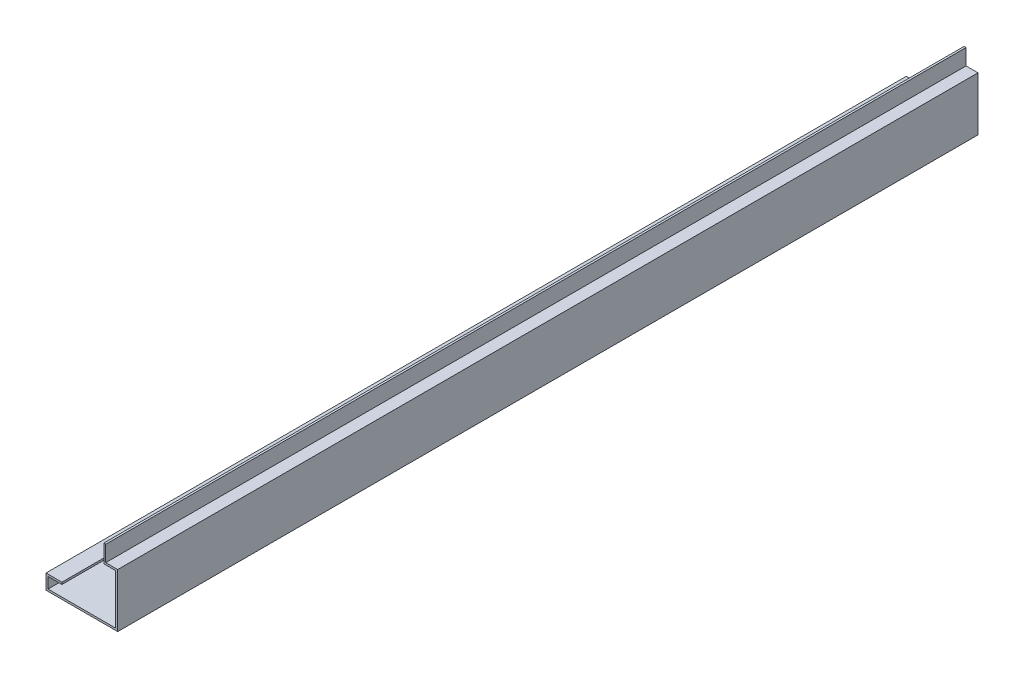
ISO-10303-21;
HEADER;
FILE_DESCRIPTION(('STEP AP214'),'2;1');
FILE_NAME('part.step','',(''),(''),'','','');
FILE_SCHEMA(('AUTOMOTIVE_DESIGN { 1 0 10303 214 1 1 1 1 }'));
ENDSEC;
DATA;
#1=APPLICATION_CONTEXT('core data for automotive mechanical design processes');
#2=APPLICATION_PROTOCOL_DEFINITION('international standard','automotive_design',2000,#1);
#3=PRODUCT_CONTEXT('',#1,'mechanical');
#4=PRODUCT('Part','Part','',(#3));
#5=PRODUCT_RELATED_PRODUCT_CATEGORY('part','',(#4));
#6=PRODUCT_DEFINITION_FORMATION('','',#4);
#7=PRODUCT_DEFINITION_CONTEXT('part definition',#1,'design');
#8=PRODUCT_DEFINITION('design','',#6,#7);
#9=PRODUCT_DEFINITION_SHAPE('','',#8);
#10=(LENGTH_UNIT() NAMED_UNIT(*) SI_UNIT(.MILLI.,.METRE.));
#11=(NAMED_UNIT(*) PLANE_ANGLE_UNIT() SI_UNIT($,.RADIAN.));
#12=(NAMED_UNIT(*) SI_UNIT($,.STERADIAN.) SOLID_ANGLE_UNIT());
#13=UNCERTAINTY_MEASURE_WITH_UNIT(LENGTH_MEASURE(1.E-05),#10,'distance_accuracy_value','');
#14=(GEOMETRIC_REPRESENTATION_CONTEXT(3) GLOBAL_UNCERTAINTY_ASSIGNED_CONTEXT((#13)) GLOBAL_UNIT_ASSIGNED_CONTEXT((#10,
#11,#12)) REPRESENTATION_CONTEXT('',''));
#15=CARTESIAN_POINT('',(0.,0.,0.));
#16=DIRECTION('',(0.,0.,1.));
#17=DIRECTION('',(1.,0.,0.));
#18=AXIS2_PLACEMENT_3D('',#15,#16,#17);
#19=CARTESIAN_POINT('',(-184.15,-180.975,-2743.2));
#20=DIRECTION('',(1.,0.,0.));
#21=DIRECTION('',(0.,0.,-1.));
#22=AXIS2_PLACEMENT_3D('',#19,#20,#21);
#23=PLANE('',#22);
#24=DIRECTION('',(0.,1.,0.));
#25=VECTOR('',#24,1.);
#26=CARTESIAN_POINT('',(-184.15,-180.975,0.));
#27=LINE('',#26,#25);
#28=CARTESIAN_POINT('',(-184.15,-215.9,0.));
#29=VERTEX_POINT('',#28);
#30=CARTESIAN_POINT('',(-184.15,-180.975,0.));
#31=VERTEX_POINT('',#30);
#32=EDGE_CURVE('E183',#29,#31,#27,.T.);
#33=ORIENTED_EDGE('',*,*,#32,.F.);
#34=DIRECTION('',(0.,0.,1.));
#35=VECTOR('',#34,1.);
#36=CARTESIAN_POINT('',(-184.15,-215.9,-2743.2));
#37=LINE('',#36,#35);
#38=CARTESIAN_POINT('',(-184.15,-215.9,-2743.2));
#39=VERTEX_POINT('',#38);
#40=EDGE_CURVE('E11',#39,#29,#37,.T.);
#41=ORIENTED_EDGE('',*,*,#40,.F.);
#42=DIRECTION('',(0.,1.,0.));
#43=VECTOR('',#42,1.);
#44=CARTESIAN_POINT('',(-184.15,-180.975,-2743.2));
#45=LINE('',#44,#43);
#46=CARTESIAN_POINT('',(-184.15,-180.975,-2743.2));
#47=VERTEX_POINT('',#46);
#48=EDGE_CURVE('E235',#39,#47,#45,.T.);
#49=ORIENTED_EDGE('',*,*,#48,.T.);
#50=DIRECTION('',(0.,0.,1.));
#51=VECTOR('',#50,1.);
#52=CARTESIAN_POINT('',(-184.15,-180.975,-2743.2));
#53=LINE('',#52,#51);
#54=EDGE_CURVE('E46',#47,#31,#53,.T.);
#55=ORIENTED_EDGE('',*,*,#54,.T.);
#56=EDGE_LOOP('',(#33,#41,#49,#55));
#57=FACE_BOUND('',#56,.T.);
#58=ADVANCED_FACE('F43',(#57),#23,.T.);
#59=CARTESIAN_POINT('',(-184.15,-215.9,-2743.2));
#60=DIRECTION('',(0.,1.,0.));
#61=DIRECTION('',(0.,0.,1.));
#62=AXIS2_PLACEMENT_3D('',#59,#60,#61);
#63=PLANE('',#62);
#64=DIRECTION('',(-1.,0.,0.));
#65=VECTOR('',#64,1.);
#66=CARTESIAN_POINT('',(-184.15,-215.9,0.));
#67=LINE('',#66,#65);
#68=CARTESIAN_POINT('',(31.75,-215.9,0.));
#69=VERTEX_POINT('',#68);
#70=EDGE_CURVE('E232',#69,#29,#67,.T.);
#71=ORIENTED_EDGE('',*,*,#70,.F.);
#72=DIRECTION('',(0.,0.,1.));
#73=VECTOR('',#72,1.);
#74=CARTESIAN_POINT('',(31.75,-215.9,-2743.2));
#75=LINE('',#74,#73);
#76=CARTESIAN_POINT('',(31.75,-215.9,-2743.2));
#77=VERTEX_POINT('',#76);
#78=EDGE_CURVE('E53',#77,#69,#75,.T.);
#79=ORIENTED_EDGE('',*,*,#78,.F.);
#80=DIRECTION('',(-1.,0.,0.));
#81=VECTOR('',#80,1.);
#82=CARTESIAN_POINT('',(-184.15,-215.9,-2743.2));
#83=LINE('',#82,#81);
#84=EDGE_CURVE('E168',#77,#39,#83,.T.);
#85=ORIENTED_EDGE('',*,*,#84,.T.);
#86=ORIENTED_EDGE('',*,*,#40,.T.);
#87=EDGE_LOOP('',(#71,#79,#85,#86));
#88=FACE_BOUND('',#87,.T.);
#89=ADVANCED_FACE('F273',(#88),#63,.T.);
#90=CARTESIAN_POINT('',(31.75,-215.9,-2743.2));
#91=DIRECTION('',(-1.,0.,0.));
#92=DIRECTION('',(0.,0.,1.));
#93=AXIS2_PLACEMENT_3D('',#90,#91,#92);
#94=PLANE('',#93);
#95=DIRECTION('',(0.,-1.,0.));
#96=VECTOR('',#95,1.);
#97=CARTESIAN_POINT('',(31.75,-215.9,0.));
#98=LINE('',#97,#96);
#99=CARTESIAN_POINT('',(31.75,-57.15,0.));
#100=VERTEX_POINT('',#99);
#101=EDGE_CURVE('E154',#100,#69,#98,.T.);
#102=ORIENTED_EDGE('',*,*,#101,.F.);
#103=DIRECTION('',(0.,0.,1.));
#104=VECTOR('',#103,1.);
#105=CARTESIAN_POINT('',(31.75,-57.15,-2743.2));
#106=LINE('',#105,#104);
#107=CARTESIAN_POINT('',(31.75,-57.15,-2743.2));
#108=VERTEX_POINT('',#107);
#109=EDGE_CURVE('E149',#108,#100,#106,.T.);
#110=ORIENTED_EDGE('',*,*,#109,.F.);
#111=DIRECTION('',(0.,-1.,0.));
#112=VECTOR('',#111,1.);
#113=CARTESIAN_POINT('',(31.75,-215.9,-2743.2));
#114=LINE('',#113,#112);
#115=EDGE_CURVE('E152',#108,#77,#114,.T.);
#116=ORIENTED_EDGE('',*,*,#115,.T.);
#117=ORIENTED_EDGE('',*,*,#78,.T.);
#118=EDGE_LOOP('',(#102,#110,#116,#117));
#119=FACE_BOUND('',#118,.T.);
#120=ADVANCED_FACE('F151',(#119),#94,.T.);
#121=CARTESIAN_POINT('',(31.75,-57.15,-2743.2));
#122=DIRECTION('',(0.,-1.,0.));
#123=DIRECTION('',(1.,0.,0.));
#124=AXIS2_PLACEMENT_3D('',#121,#122,#123);
#125=PLANE('',#124);
#126=DIRECTION('',(1.,0.,0.));
#127=VECTOR('',#126,1.);
#128=CARTESIAN_POINT('',(31.75,-57.15,0.));
#129=LINE('',#128,#127);
#130=CARTESIAN_POINT('',(-6.34999999999999,-57.15,0.));
#131=VERTEX_POINT('',#130);
#132=EDGE_CURVE('E227',#131,#100,#129,.T.);
#133=ORIENTED_EDGE('',*,*,#132,.F.);
#134=DIRECTION('',(0.,0.,1.));
#135=VECTOR('',#134,1.);
#136=CARTESIAN_POINT('',(-6.34999999999999,-57.15,-2743.2));
#137=LINE('',#136,#135);
#138=CARTESIAN_POINT('',(-6.34999999999999,-57.15,-2743.2));
#139=VERTEX_POINT('',#138);
#140=EDGE_CURVE('E160',#139,#131,#137,.T.);
#141=ORIENTED_EDGE('',*,*,#140,.F.);
#142=DIRECTION('',(1.,0.,0.));
#143=VECTOR('',#142,1.);
#144=CARTESIAN_POINT('',(31.75,-57.15,-2743.2));
#145=LINE('',#144,#143);
#146=EDGE_CURVE('E166',#139,#108,#145,.T.);
#147=ORIENTED_EDGE('',*,*,#146,.T.);
#148=ORIENTED_EDGE('',*,*,#109,.T.);
#149=EDGE_LOOP('',(#133,#141,#147,#148));
#150=FACE_BOUND('',#149,.T.);
#151=ADVANCED_FACE('F171',(#150),#125,.T.);
#152=CARTESIAN_POINT('',(-6.34999999999999,-57.15,-2743.2));
#153=DIRECTION('',(-1.,0.,0.));
#154=DIRECTION('',(0.,0.,1.));
#155=AXIS2_PLACEMENT_3D('',#152,#153,#154);
#156=PLANE('',#155);
#157=DIRECTION('',(0.,-1.,0.));
#158=VECTOR('',#157,1.);
#159=CARTESIAN_POINT('',(-6.34999999999999,-57.15,0.));
#160=LINE('',#159,#158);
#161=CARTESIAN_POINT('',(-6.34999999999999,0.,0.));
#162=VERTEX_POINT('',#161);
#163=EDGE_CURVE('E223',#162,#131,#160,.T.);
#164=ORIENTED_EDGE('',*,*,#163,.F.);
#165=DIRECTION('',(0.,0.,1.));
#166=VECTOR('',#165,1.);
#167=CARTESIAN_POINT('',(-6.34999999999999,0.,-2743.2));
#168=LINE('',#167,#166);
#169=CARTESIAN_POINT('',(-6.34999999999999,0.,-2743.2));
#170=VERTEX_POINT('',#169);
#171=EDGE_CURVE('E241',#170,#162,#168,.T.);
#172=ORIENTED_EDGE('',*,*,#171,.F.);
#173=DIRECTION('',(0.,-1.,0.));
#174=VECTOR('',#173,1.);
#175=CARTESIAN_POINT('',(-6.34999999999999,-57.15,-2743.2));
#176=LINE('',#175,#174);
#177=EDGE_CURVE('E173',#170,#139,#176,.T.);
#178=ORIENTED_EDGE('',*,*,#177,.T.);
#179=ORIENTED_EDGE('',*,*,#140,.T.);
#180=EDGE_LOOP('',(#164,#172,#178,#179));
#181=FACE_BOUND('',#180,.T.);
#182=ADVANCED_FACE('F286',(#181),#156,.T.);
#183=CARTESIAN_POINT('',(-6.34999999999999,0.,-2743.2));
#184=DIRECTION('',(0.,1.,0.));
#185=DIRECTION('',(0.,0.,1.));
#186=AXIS2_PLACEMENT_3D('',#183,#184,#185);
#187=PLANE('',#186);
#188=DIRECTION('',(-1.,0.,0.));
#189=VECTOR('',#188,1.);
#190=CARTESIAN_POINT('',(-6.34999999999999,0.,0.));
#191=LINE('',#190,#189);
#192=CARTESIAN_POINT('',(0.,0.,0.));
#193=VERTEX_POINT('',#192);
#194=EDGE_CURVE('E219',#193,#162,#191,.T.);
#195=ORIENTED_EDGE('',*,*,#194,.F.);
#196=DIRECTION('',(0.,0.,1.));
#197=VECTOR('',#196,1.);
#198=CARTESIAN_POINT('',(0.,0.,-2743.2));
#199=LINE('',#198,#197);
#200=CARTESIAN_POINT('',(0.,0.,-2743.2));
#201=VERTEX_POINT('',#200);
#202=EDGE_CURVE('E244',#201,#193,#199,.T.);
#203=ORIENTED_EDGE('',*,*,#202,.F.);
#204=DIRECTION('',(-1.,0.,0.));
#205=VECTOR('',#204,1.);
#206=CARTESIAN_POINT('',(-6.34999999999999,0.,-2743.2));
#207=LINE('',#206,#205);
#208=EDGE_CURVE('E177',#201,#170,#207,.T.);
#209=ORIENTED_EDGE('',*,*,#208,.T.);
#210=ORIENTED_EDGE('',*,*,#171,.T.);
#211=EDGE_LOOP('',(#195,#203,#209,#210));
#212=FACE_BOUND('',#211,.T.);
#213=ADVANCED_FACE('F289',(#212),#187,.T.);
#214=CARTESIAN_POINT('',(0.,0.,-2743.2));
#215=DIRECTION('',(1.,0.,0.));
#216=DIRECTION('',(0.,1.,0.));
#217=AXIS2_PLACEMENT_3D('',#214,#215,#216);
#218=PLANE('',#217);
#219=DIRECTION('',(0.,1.,0.));
#220=VECTOR('',#219,1.);
#221=CARTESIAN_POINT('',(0.,0.,0.));
#222=LINE('',#221,#220);
#223=CARTESIAN_POINT('',(0.,-50.8,0.));
#224=VERTEX_POINT('',#223);
#225=EDGE_CURVE('E215',#224,#193,#222,.T.);
#226=ORIENTED_EDGE('',*,*,#225,.F.);
#227=DIRECTION('',(0.,0.,1.));
#228=VECTOR('',#227,1.);
#229=CARTESIAN_POINT('',(0.,-50.8,-2743.2));
#230=LINE('',#229,#228);
#231=CARTESIAN_POINT('',(0.,-50.8,-2743.2));
#232=VERTEX_POINT('',#231);
#233=EDGE_CURVE('E247',#232,#224,#230,.T.);
#234=ORIENTED_EDGE('',*,*,#233,.F.);
#235=DIRECTION('',(0.,1.,0.));
#236=VECTOR('',#235,1.);
#237=CARTESIAN_POINT('',(0.,0.,-2743.2));
#238=LINE('',#237,#236);
#239=EDGE_CURVE('E478',#232,#201,#238,.T.);
#240=ORIENTED_EDGE('',*,*,#239,.T.);
#241=ORIENTED_EDGE('',*,*,#202,.T.);
#242=EDGE_LOOP('',(#226,#234,#240,#241));
#243=FACE_BOUND('',#242,.T.);
#244=ADVANCED_FACE('F293',(#243),#218,.T.);
#245=CARTESIAN_POINT('',(0.,-50.8,-2743.2));
#246=DIRECTION('',(0.,1.,0.));
#247=DIRECTION('',(-1.,0.,0.));
#248=AXIS2_PLACEMENT_3D('',#245,#246,#247);
#249=PLANE('',#248);
#250=DIRECTION('',(-1.,0.,0.));
#251=VECTOR('',#250,1.);
#252=CARTESIAN_POINT('',(0.,-50.8,0.));
#253=LINE('',#252,#251);
#254=CARTESIAN_POINT('',(38.1,-50.8,0.));
#255=VERTEX_POINT('',#254);
#256=EDGE_CURVE('E211',#255,#224,#253,.T.);
#257=ORIENTED_EDGE('',*,*,#256,.F.);
#258=DIRECTION('',(0.,0.,1.));
#259=VECTOR('',#258,1.);
#260=CARTESIAN_POINT('',(38.1,-50.8,-2743.2));
#261=LINE('',#260,#259);
#262=CARTESIAN_POINT('',(38.1,-50.8,-2743.2));
#263=VERTEX_POINT('',#262);
#264=EDGE_CURVE('E250',#263,#255,#261,.T.);
#265=ORIENTED_EDGE('',*,*,#264,.F.);
#266=DIRECTION('',(-1.,0.,0.));
#267=VECTOR('',#266,1.);
#268=CARTESIAN_POINT('',(0.,-50.8,-2743.2));
#269=LINE('',#268,#267);
#270=EDGE_CURVE('E471',#263,#232,#269,.T.);
#271=ORIENTED_EDGE('',*,*,#270,.T.);
#272=ORIENTED_EDGE('',*,*,#233,.T.);
#273=EDGE_LOOP('',(#257,#265,#271,#272));
#274=FACE_BOUND('',#273,.T.);
#275=ADVANCED_FACE('F297',(#274),#249,.T.);
#276=CARTESIAN_POINT('',(38.1,-50.8,-2743.2));
#277=DIRECTION('',(1.,0.,0.));
#278=DIRECTION('',(0.,1.,0.));
#279=AXIS2_PLACEMENT_3D('',#276,#277,#278);
#280=PLANE('',#279);
#281=DIRECTION('',(0.,1.,0.));
#282=VECTOR('',#281,1.);
#283=CARTESIAN_POINT('',(38.1,-50.8,0.));
#284=LINE('',#283,#282);
#285=CARTESIAN_POINT('',(38.1,-222.25,0.));
#286=VERTEX_POINT('',#285);
#287=EDGE_CURVE('E207',#286,#255,#284,.T.);
#288=ORIENTED_EDGE('',*,*,#287,.F.);
#289=DIRECTION('',(0.,0.,1.));
#290=VECTOR('',#289,1.);
#291=CARTESIAN_POINT('',(38.1,-222.25,-2743.2));
#292=LINE('',#291,#290);
#293=CARTESIAN_POINT('',(38.1,-222.25,-2743.2));
#294=VERTEX_POINT('',#293);
#295=EDGE_CURVE('E253',#294,#286,#292,.T.);
#296=ORIENTED_EDGE('',*,*,#295,.F.);
#297=DIRECTION('',(0.,1.,0.));
#298=VECTOR('',#297,1.);
#299=CARTESIAN_POINT('',(38.1,-50.8,-2743.2));
#300=LINE('',#299,#298);
#301=EDGE_CURVE('E467',#294,#263,#300,.T.);
#302=ORIENTED_EDGE('',*,*,#301,.T.);
#303=ORIENTED_EDGE('',*,*,#264,.T.);
#304=EDGE_LOOP('',(#288,#296,#302,#303));
#305=FACE_BOUND('',#304,.T.);
#306=ADVANCED_FACE('F301',(#305),#280,.T.);
#307=CARTESIAN_POINT('',(38.1,-222.25,-2743.2));
#308=DIRECTION('',(0.,-1.,0.));
#309=DIRECTION('',(1.,0.,0.));
#310=AXIS2_PLACEMENT_3D('',#307,#308,#309);
#311=PLANE('',#310);
#312=DIRECTION('',(1.,0.,0.));
#313=VECTOR('',#312,1.);
#314=CARTESIAN_POINT('',(38.1,-222.25,0.));
#315=LINE('',#314,#313);
#316=CARTESIAN_POINT('',(-190.5,-222.25,0.));
#317=VERTEX_POINT('',#316);
#318=EDGE_CURVE('E203',#317,#286,#315,.T.);
#319=ORIENTED_EDGE('',*,*,#318,.F.);
#320=DIRECTION('',(0.,0.,1.));
#321=VECTOR('',#320,1.);
#322=CARTESIAN_POINT('',(-190.5,-222.25,-2743.2));
#323=LINE('',#322,#321);
#324=CARTESIAN_POINT('',(-190.5,-222.25,-2743.2));
#325=VERTEX_POINT('',#324);
#326=EDGE_CURVE('E256',#325,#317,#323,.T.);
#327=ORIENTED_EDGE('',*,*,#326,.F.);
#328=DIRECTION('',(1.,0.,0.));
#329=VECTOR('',#328,1.);
#330=CARTESIAN_POINT('',(38.1,-222.25,-2743.2));
#331=LINE('',#330,#329);
#332=EDGE_CURVE('E488',#325,#294,#331,.T.);
#333=ORIENTED_EDGE('',*,*,#332,.T.);
#334=ORIENTED_EDGE('',*,*,#295,.T.);
#335=EDGE_LOOP('',(#319,#327,#333,#334));
#336=FACE_BOUND('',#335,.T.);
#337=ADVANCED_FACE('F305',(#336),#311,.T.);
#338=CARTESIAN_POINT('',(-190.5,-222.25,-2743.2));
#339=DIRECTION('',(-1.,0.,0.));
#340=DIRECTION('',(0.,0.,1.));
#341=AXIS2_PLACEMENT_3D('',#338,#339,#340);
#342=PLANE('',#341);
#343=DIRECTION('',(0.,-1.,0.));
#344=VECTOR('',#343,1.);
#345=CARTESIAN_POINT('',(-190.5,-222.25,0.));
#346=LINE('',#345,#344);
#347=CARTESIAN_POINT('',(-190.5,-174.625,0.));
#348=VERTEX_POINT('',#347);
#349=EDGE_CURVE('E199',#348,#317,#346,.T.);
#350=ORIENTED_EDGE('',*,*,#349,.F.);
#351=DIRECTION('',(0.,0.,1.));
#352=VECTOR('',#351,1.);
#353=CARTESIAN_POINT('',(-190.5,-174.625,-2743.2));
#354=LINE('',#353,#352);
#355=CARTESIAN_POINT('',(-190.5,-174.625,-2743.2));
#356=VERTEX_POINT('',#355);
#357=EDGE_CURVE('E259',#356,#348,#354,.T.);
#358=ORIENTED_EDGE('',*,*,#357,.F.);
#359=DIRECTION('',(0.,-1.,0.));
#360=VECTOR('',#359,1.);
#361=CARTESIAN_POINT('',(-190.5,-222.25,-2743.2));
#362=LINE('',#361,#360);
#363=EDGE_CURVE('E460',#356,#325,#362,.T.);
#364=ORIENTED_EDGE('',*,*,#363,.T.);
#365=ORIENTED_EDGE('',*,*,#326,.T.);
#366=EDGE_LOOP('',(#350,#358,#364,#365));
#367=FACE_BOUND('',#366,.T.);
#368=ADVANCED_FACE('F309',(#367),#342,.T.);
#369=CARTESIAN_POINT('',(-190.5,-174.625,-2743.2));
#370=DIRECTION('',(0.,1.,0.));
#371=DIRECTION('',(-1.,0.,0.));
#372=AXIS2_PLACEMENT_3D('',#369,#370,#371);
#373=PLANE('',#372);
#374=DIRECTION('',(-1.,0.,0.));
#375=VECTOR('',#374,1.);
#376=CARTESIAN_POINT('',(-190.5,-174.625,0.));
#377=LINE('',#376,#375);
#378=CARTESIAN_POINT('',(-139.7,-174.625,0.));
#379=VERTEX_POINT('',#378);
#380=EDGE_CURVE('E195',#379,#348,#377,.T.);
#381=ORIENTED_EDGE('',*,*,#380,.F.);
#382=DIRECTION('',(0.,0.,1.));
#383=VECTOR('',#382,1.);
#384=CARTESIAN_POINT('',(-139.7,-174.625,-2743.2));
#385=LINE('',#384,#383);
#386=CARTESIAN_POINT('',(-139.7,-174.625,-2743.2));
#387=VERTEX_POINT('',#386);
#388=EDGE_CURVE('E262',#387,#379,#385,.T.);
#389=ORIENTED_EDGE('',*,*,#388,.F.);
#390=DIRECTION('',(-1.,0.,0.));
#391=VECTOR('',#390,1.);
#392=CARTESIAN_POINT('',(-190.5,-174.625,-2743.2));
#393=LINE('',#392,#391);
#394=EDGE_CURVE('E456',#387,#356,#393,.T.);
#395=ORIENTED_EDGE('',*,*,#394,.T.);
#396=ORIENTED_EDGE('',*,*,#357,.T.);
#397=EDGE_LOOP('',(#381,#389,#395,#396));
#398=FACE_BOUND('',#397,.T.);
#399=ADVANCED_FACE('F313',(#398),#373,.T.);
#400=CARTESIAN_POINT('',(-139.7,-174.625,-2743.2));
#401=DIRECTION('',(1.,0.,0.));
#402=DIRECTION('',(0.,0.,-1.));
#403=AXIS2_PLACEMENT_3D('',#400,#401,#402);
#404=PLANE('',#403);
#405=DIRECTION('',(0.,1.,0.));
#406=VECTOR('',#405,1.);
#407=CARTESIAN_POINT('',(-139.7,-174.625,0.));
#408=LINE('',#407,#406);
#409=CARTESIAN_POINT('',(-139.7,-180.975,0.));
#410=VERTEX_POINT('',#409);
#411=EDGE_CURVE('E191',#410,#379,#408,.T.);
#412=ORIENTED_EDGE('',*,*,#411,.F.);
#413=DIRECTION('',(0.,0.,1.));
#414=VECTOR('',#413,1.);
#415=CARTESIAN_POINT('',(-139.7,-180.975,-2743.2));
#416=LINE('',#415,#414);
#417=CARTESIAN_POINT('',(-139.7,-180.975,-2743.2));
#418=VERTEX_POINT('',#417);
#419=EDGE_CURVE('E264',#418,#410,#416,.T.);
#420=ORIENTED_EDGE('',*,*,#419,.F.);
#421=DIRECTION('',(0.,1.,0.));
#422=VECTOR('',#421,1.);
#423=CARTESIAN_POINT('',(-139.7,-174.625,-2743.2));
#424=LINE('',#423,#422);
#425=EDGE_CURVE('E495',#418,#387,#424,.T.);
#426=ORIENTED_EDGE('',*,*,#425,.T.);
#427=ORIENTED_EDGE('',*,*,#388,.T.);
#428=EDGE_LOOP('',(#412,#420,#426,#427));
#429=FACE_BOUND('',#428,.T.);
#430=ADVANCED_FACE('F317',(#429),#404,.T.);
#431=CARTESIAN_POINT('',(-139.7,-180.975,-2743.2));
#432=DIRECTION('',(0.,-1.,0.));
#433=DIRECTION('',(0.,0.,-1.));
#434=AXIS2_PLACEMENT_3D('',#431,#432,#433);
#435=PLANE('',#434);
#436=DIRECTION('',(1.,0.,0.));
#437=VECTOR('',#436,1.);
#438=CARTESIAN_POINT('',(-139.7,-180.975,0.));
#439=LINE('',#438,#437);
#440=EDGE_CURVE('E187',#31,#410,#439,.T.);
#441=ORIENTED_EDGE('',*,*,#440,.F.);
#442=ORIENTED_EDGE('',*,*,#54,.F.);
#443=DIRECTION('',(1.,0.,0.));
#444=VECTOR('',#443,1.);
#445=CARTESIAN_POINT('',(-139.7,-180.975,-2743.2));
#446=LINE('',#445,#444);
#447=EDGE_CURVE('E498',#47,#418,#446,.T.);
#448=ORIENTED_EDGE('',*,*,#447,.T.);
#449=ORIENTED_EDGE('',*,*,#419,.T.);
#450=EDGE_LOOP('',(#441,#442,#448,#449));
#451=FACE_BOUND('',#450,.T.);
#452=ADVANCED_FACE('F270',(#451),#435,.T.);
#453=CARTESIAN_POINT('',(0.,0.,-2743.2));
#454=DIRECTION('',(0.,0.,1.));
#455=DIRECTION('',(1.,0.,0.));
#456=AXIS2_PLACEMENT_3D('',#453,#454,#455);
#457=PLANE('',#456);
#458=ORIENTED_EDGE('',*,*,#48,.F.);
#459=ORIENTED_EDGE('',*,*,#84,.F.);
#460=ORIENTED_EDGE('',*,*,#115,.F.);
#461=ORIENTED_EDGE('',*,*,#146,.F.);
#462=ORIENTED_EDGE('',*,*,#177,.F.);
#463=ORIENTED_EDGE('',*,*,#208,.F.);
#464=ORIENTED_EDGE('',*,*,#239,.F.);
#465=ORIENTED_EDGE('',*,*,#270,.F.);
#466=ORIENTED_EDGE('',*,*,#301,.F.);
#467=ORIENTED_EDGE('',*,*,#332,.F.);
#468=ORIENTED_EDGE('',*,*,#363,.F.);
#469=ORIENTED_EDGE('',*,*,#394,.F.);
#470=ORIENTED_EDGE('',*,*,#425,.F.);
#471=ORIENTED_EDGE('',*,*,#447,.F.);
#472=EDGE_LOOP('',(#458,#459,#460,#461,#462,#463,#464,#465,#466,#467,#468,#469,#470,#471));
#473=FACE_BOUND('',#472,.T.);
#474=ADVANCED_FACE('F164',(#473),#457,.F.);
#475=CARTESIAN_POINT('',(0.,0.,0.));
#476=DIRECTION('',(0.,0.,1.));
#477=DIRECTION('',(1.,0.,0.));
#478=AXIS2_PLACEMENT_3D('',#475,#476,#477);
#479=PLANE('',#478);
#480=ORIENTED_EDGE('',*,*,#32,.T.);
#481=ORIENTED_EDGE('',*,*,#440,.T.);
#482=ORIENTED_EDGE('',*,*,#411,.T.);
#483=ORIENTED_EDGE('',*,*,#380,.T.);
#484=ORIENTED_EDGE('',*,*,#349,.T.);
#485=ORIENTED_EDGE('',*,*,#318,.T.);
#486=ORIENTED_EDGE('',*,*,#287,.T.);
#487=ORIENTED_EDGE('',*,*,#256,.T.);
#488=ORIENTED_EDGE('',*,*,#225,.T.);
#489=ORIENTED_EDGE('',*,*,#194,.T.);
#490=ORIENTED_EDGE('',*,*,#163,.T.);
#491=ORIENTED_EDGE('',*,*,#132,.T.);
#492=ORIENTED_EDGE('',*,*,#101,.T.);
#493=ORIENTED_EDGE('',*,*,#70,.T.);
#494=EDGE_LOOP('',(#480,#481,#482,#483,#484,#485,#486,#487,#488,#489,#490,#491,#492,#493));
#495=FACE_BOUND('',#494,.T.);
#496=ADVANCED_FACE('F272',(#495),#479,.T.);
#497=CLOSED_SHELL('',(#58,#89,#120,#151,#182,#213,#244,#275,#306,#337,#368,#399,#430,#452,#474,#496));
#498=MANIFOLD_SOLID_BREP('B2',#497);
#499=ADVANCED_BREP_SHAPE_REPRESENTATION('',(#18,#498),#14);
#500=SHAPE_DEFINITION_REPRESENTATION(#9,#499);
ENDSEC;
END-ISO-10303-21;
